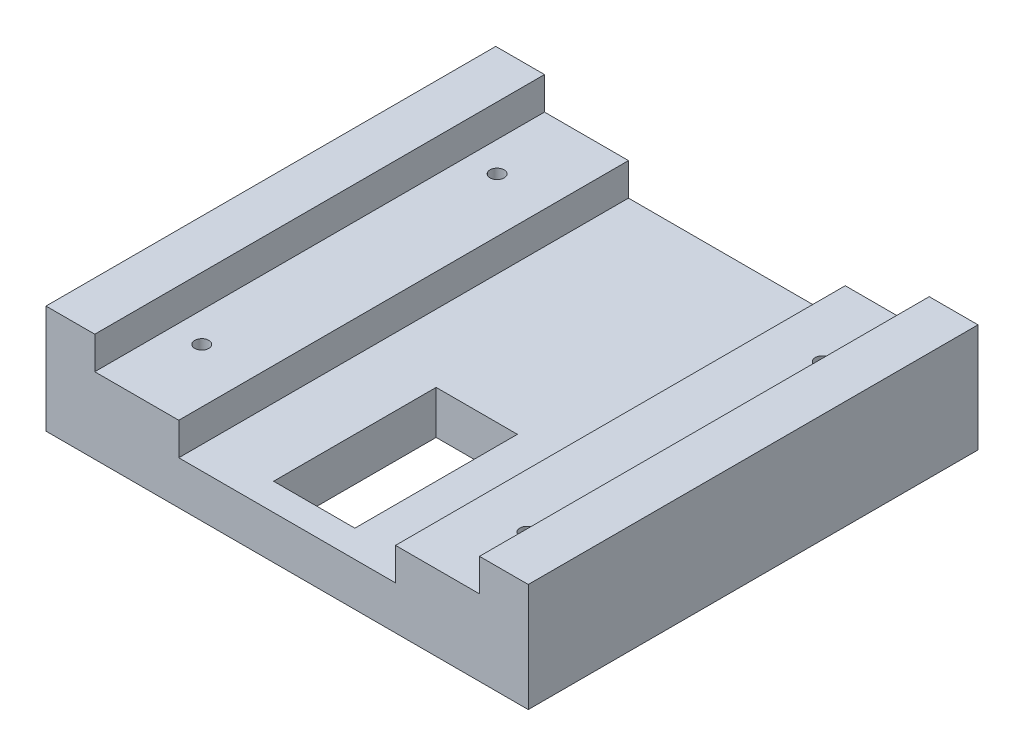
ISO-10303-21;
HEADER;
FILE_DESCRIPTION(('STEP AP214'),'2;1');
FILE_NAME('part.step','',(''),(''),'','','');
FILE_SCHEMA(('AUTOMOTIVE_DESIGN { 1 0 10303 214 1 1 1 1 }'));
ENDSEC;
DATA;
#1=APPLICATION_CONTEXT('core data for automotive mechanical design processes');
#2=APPLICATION_PROTOCOL_DEFINITION('international standard','automotive_design',2000,#1);
#3=PRODUCT_CONTEXT('',#1,'mechanical');
#4=PRODUCT('Part','Part','',(#3));
#5=PRODUCT_RELATED_PRODUCT_CATEGORY('part','',(#4));
#6=PRODUCT_DEFINITION_FORMATION('','',#4);
#7=PRODUCT_DEFINITION_CONTEXT('part definition',#1,'design');
#8=PRODUCT_DEFINITION('design','',#6,#7);
#9=PRODUCT_DEFINITION_SHAPE('','',#8);
#10=(LENGTH_UNIT() NAMED_UNIT(*) SI_UNIT(.MILLI.,.METRE.));
#11=(NAMED_UNIT(*) PLANE_ANGLE_UNIT() SI_UNIT($,.RADIAN.));
#12=(NAMED_UNIT(*) SI_UNIT($,.STERADIAN.) SOLID_ANGLE_UNIT());
#13=UNCERTAINTY_MEASURE_WITH_UNIT(LENGTH_MEASURE(1.E-05),#10,'distance_accuracy_value','');
#14=(GEOMETRIC_REPRESENTATION_CONTEXT(3) GLOBAL_UNCERTAINTY_ASSIGNED_CONTEXT((#13)) GLOBAL_UNIT_ASSIGNED_CONTEXT((#10,
#11,#12)) REPRESENTATION_CONTEXT('',''));
#15=CARTESIAN_POINT('',(0.,0.,0.));
#16=DIRECTION('',(0.,0.,1.));
#17=DIRECTION('',(1.,0.,0.));
#18=AXIS2_PLACEMENT_3D('',#15,#16,#17);
#19=CARTESIAN_POINT('',(0.,14.,0.));
#20=DIRECTION('',(0.,1.,0.));
#21=DIRECTION('',(0.,0.,1.));
#22=AXIS2_PLACEMENT_3D('',#19,#20,#21);
#23=PLANE('',#22);
#24=CARTESIAN_POINT('',(30.,14.,-68.75));
#25=DIRECTION('',(0.,1.,0.));
#26=DIRECTION('',(0.,0.,1.));
#27=AXIS2_PLACEMENT_3D('',#24,#25,#26);
#28=CIRCLE('',#27,1.29999999999999);
#29=CARTESIAN_POINT('',(30.,14.,-67.45));
#30=VERTEX_POINT('',#29);
#31=EDGE_CURVE('E236',#30,#30,#28,.T.);
#32=ORIENTED_EDGE('',*,*,#31,.F.);
#33=EDGE_LOOP('',(#32));
#34=FACE_BOUND('',#33,.T.);
#35=CARTESIAN_POINT('',(30.,14.,-14.25));
#36=DIRECTION('',(0.,1.,0.));
#37=DIRECTION('',(0.,0.,1.));
#38=AXIS2_PLACEMENT_3D('',#35,#36,#37);
#39=CIRCLE('',#38,1.3);
#40=CARTESIAN_POINT('',(30.,14.,-12.95));
#41=VERTEX_POINT('',#40);
#42=EDGE_CURVE('E246',#41,#41,#39,.T.);
#43=ORIENTED_EDGE('',*,*,#42,.F.);
#44=EDGE_LOOP('',(#43));
#45=FACE_BOUND('',#44,.T.);
#46=DIRECTION('',(1.,0.,0.));
#47=VECTOR('',#46,1.);
#48=CARTESIAN_POINT('',(0.,14.,0.));
#49=LINE('',#48,#47);
#50=CARTESIAN_POINT('',(20.,14.,0.));
#51=VERTEX_POINT('',#50);
#52=CARTESIAN_POINT('',(35.5,14.,0.));
#53=VERTEX_POINT('',#52);
#54=EDGE_CURVE('E55',#51,#53,#49,.T.);
#55=ORIENTED_EDGE('',*,*,#54,.T.);
#56=DIRECTION('',(0.,0.,1.));
#57=VECTOR('',#56,1.);
#58=CARTESIAN_POINT('',(35.5,14.,0.));
#59=LINE('',#58,#57);
#60=CARTESIAN_POINT('',(35.5,14.,-83.));
#61=VERTEX_POINT('',#60);
#62=EDGE_CURVE('E50',#61,#53,#59,.T.);
#63=ORIENTED_EDGE('',*,*,#62,.F.);
#64=DIRECTION('',(1.,0.,0.));
#65=VECTOR('',#64,1.);
#66=CARTESIAN_POINT('',(0.,14.,-83.));
#67=LINE('',#66,#65);
#68=CARTESIAN_POINT('',(20.,14.,-83.));
#69=VERTEX_POINT('',#68);
#70=EDGE_CURVE('E251',#69,#61,#67,.T.);
#71=ORIENTED_EDGE('',*,*,#70,.F.);
#72=DIRECTION('',(0.,0.,-1.));
#73=VECTOR('',#72,1.);
#74=CARTESIAN_POINT('',(20.,14.,0.));
#75=LINE('',#74,#73);
#76=EDGE_CURVE('E205',#51,#69,#75,.T.);
#77=ORIENTED_EDGE('',*,*,#76,.F.);
#78=EDGE_LOOP('',(#55,#63,#71,#77));
#79=FACE_BOUND('',#78,.T.);
#80=ADVANCED_FACE('F35',(#34,#45,#79),#23,.T.);
#81=CARTESIAN_POINT('',(-30.,14.,-14.25));
#82=DIRECTION('',(0.,1.,0.));
#83=DIRECTION('',(0.,0.,1.));
#84=AXIS2_PLACEMENT_3D('',#81,#82,#83);
#85=CIRCLE('',#84,1.3);
#86=CARTESIAN_POINT('',(-30.,14.,-12.95));
#87=VERTEX_POINT('',#86);
#88=EDGE_CURVE('E243',#87,#87,#85,.T.);
#89=ORIENTED_EDGE('',*,*,#88,.F.);
#90=EDGE_LOOP('',(#89));
#91=FACE_BOUND('',#90,.T.);
#92=CARTESIAN_POINT('',(-30.,14.,-68.75));
#93=DIRECTION('',(0.,1.,0.));
#94=DIRECTION('',(0.,0.,1.));
#95=AXIS2_PLACEMENT_3D('',#92,#93,#94);
#96=CIRCLE('',#95,1.29999999999999);
#97=CARTESIAN_POINT('',(-30.,14.,-67.45));
#98=VERTEX_POINT('',#97);
#99=EDGE_CURVE('E239',#98,#98,#96,.T.);
#100=ORIENTED_EDGE('',*,*,#99,.F.);
#101=EDGE_LOOP('',(#100));
#102=FACE_BOUND('',#101,.T.);
#103=CARTESIAN_POINT('',(-35.5,14.,-83.));
#104=VERTEX_POINT('',#103);
#105=CARTESIAN_POINT('',(-20.,14.,-83.));
#106=VERTEX_POINT('',#105);
#107=EDGE_CURVE('E252',#104,#106,#67,.T.);
#108=ORIENTED_EDGE('',*,*,#107,.F.);
#109=DIRECTION('',(0.,0.,-1.));
#110=VECTOR('',#109,1.);
#111=CARTESIAN_POINT('',(-35.5,14.,-83.));
#112=LINE('',#111,#110);
#113=CARTESIAN_POINT('',(-35.5,14.,0.));
#114=VERTEX_POINT('',#113);
#115=EDGE_CURVE('E183',#114,#104,#112,.T.);
#116=ORIENTED_EDGE('',*,*,#115,.F.);
#117=CARTESIAN_POINT('',(-20.,14.,0.));
#118=VERTEX_POINT('',#117);
#119=EDGE_CURVE('E249',#114,#118,#49,.T.);
#120=ORIENTED_EDGE('',*,*,#119,.T.);
#121=DIRECTION('',(0.,0.,1.));
#122=VECTOR('',#121,1.);
#123=CARTESIAN_POINT('',(-20.,14.,0.));
#124=LINE('',#123,#122);
#125=EDGE_CURVE('E200',#106,#118,#124,.T.);
#126=ORIENTED_EDGE('',*,*,#125,.F.);
#127=EDGE_LOOP('',(#108,#116,#120,#126));
#128=FACE_BOUND('',#127,.T.);
#129=ADVANCED_FACE('F332',(#91,#102,#128),#23,.T.);
#130=CARTESIAN_POINT('',(0.,14.,0.));
#131=DIRECTION('',(0.,0.,-1.));
#132=DIRECTION('',(-1.,0.,0.));
#133=AXIS2_PLACEMENT_3D('',#130,#131,#132);
#134=PLANE('',#133);
#135=DIRECTION('',(1.,0.,0.));
#136=VECTOR('',#135,1.);
#137=CARTESIAN_POINT('',(-20.,8.,0.));
#138=LINE('',#137,#136);
#139=CARTESIAN_POINT('',(-20.,8.,0.));
#140=VERTEX_POINT('',#139);
#141=CARTESIAN_POINT('',(20.,8.,0.));
#142=VERTEX_POINT('',#141);
#143=EDGE_CURVE('E204',#140,#142,#138,.T.);
#144=ORIENTED_EDGE('',*,*,#143,.F.);
#145=DIRECTION('',(0.,1.,0.));
#146=VECTOR('',#145,1.);
#147=CARTESIAN_POINT('',(-20.,8.,0.));
#148=LINE('',#147,#146);
#149=EDGE_CURVE('E214',#140,#118,#148,.T.);
#150=ORIENTED_EDGE('',*,*,#149,.T.);
#151=ORIENTED_EDGE('',*,*,#119,.F.);
#152=DIRECTION('',(0.,-1.,0.));
#153=VECTOR('',#152,1.);
#154=CARTESIAN_POINT('',(-35.5,20.,0.));
#155=LINE('',#154,#153);
#156=CARTESIAN_POINT('',(-35.5,20.,0.));
#157=VERTEX_POINT('',#156);
#158=EDGE_CURVE('E198',#157,#114,#155,.T.);
#159=ORIENTED_EDGE('',*,*,#158,.F.);
#160=DIRECTION('',(1.,0.,0.));
#161=VECTOR('',#160,1.);
#162=CARTESIAN_POINT('',(-44.5,20.,0.));
#163=LINE('',#162,#161);
#164=CARTESIAN_POINT('',(-44.5,20.,0.));
#165=VERTEX_POINT('',#164);
#166=EDGE_CURVE('E187',#165,#157,#163,.T.);
#167=ORIENTED_EDGE('',*,*,#166,.F.);
#168=DIRECTION('',(0.,-1.,0.));
#169=VECTOR('',#168,1.);
#170=CARTESIAN_POINT('',(-44.5,14.,0.));
#171=LINE('',#170,#169);
#172=CARTESIAN_POINT('',(-44.5,0.,0.));
#173=VERTEX_POINT('',#172);
#174=EDGE_CURVE('E286',#165,#173,#171,.T.);
#175=ORIENTED_EDGE('',*,*,#174,.T.);
#176=DIRECTION('',(1.,0.,0.));
#177=VECTOR('',#176,1.);
#178=CARTESIAN_POINT('',(0.,0.,0.));
#179=LINE('',#178,#177);
#180=CARTESIAN_POINT('',(44.5,0.,0.));
#181=VERTEX_POINT('',#180);
#182=EDGE_CURVE('E278',#173,#181,#179,.T.);
#183=ORIENTED_EDGE('',*,*,#182,.T.);
#184=DIRECTION('',(0.,-1.,0.));
#185=VECTOR('',#184,1.);
#186=CARTESIAN_POINT('',(44.5,14.,0.));
#187=LINE('',#186,#185);
#188=CARTESIAN_POINT('',(44.5,20.,0.));
#189=VERTEX_POINT('',#188);
#190=EDGE_CURVE('E43',#189,#181,#187,.T.);
#191=ORIENTED_EDGE('',*,*,#190,.F.);
#192=DIRECTION('',(1.,0.,0.));
#193=VECTOR('',#192,1.);
#194=CARTESIAN_POINT('',(44.5,20.,0.));
#195=LINE('',#194,#193);
#196=CARTESIAN_POINT('',(35.5,20.,0.));
#197=VERTEX_POINT('',#196);
#198=EDGE_CURVE('E173',#197,#189,#195,.T.);
#199=ORIENTED_EDGE('',*,*,#198,.F.);
#200=DIRECTION('',(0.,-1.,0.));
#201=VECTOR('',#200,1.);
#202=CARTESIAN_POINT('',(35.5,20.,0.));
#203=LINE('',#202,#201);
#204=EDGE_CURVE('E178',#197,#53,#203,.T.);
#205=ORIENTED_EDGE('',*,*,#204,.T.);
#206=ORIENTED_EDGE('',*,*,#54,.F.);
#207=DIRECTION('',(0.,1.,0.));
#208=VECTOR('',#207,1.);
#209=CARTESIAN_POINT('',(20.,8.,0.));
#210=LINE('',#209,#208);
#211=EDGE_CURVE('E225',#142,#51,#210,.T.);
#212=ORIENTED_EDGE('',*,*,#211,.F.);
#213=EDGE_LOOP('',(#144,#150,#151,#159,#167,#175,#183,#191,#199,#205,#206,#212));
#214=FACE_BOUND('',#213,.T.);
#215=ADVANCED_FACE('F338',(#214),#134,.F.);
#216=CARTESIAN_POINT('',(44.5,14.,0.));
#217=DIRECTION('',(-1.,0.,0.));
#218=DIRECTION('',(0.,0.,1.));
#219=AXIS2_PLACEMENT_3D('',#216,#217,#218);
#220=PLANE('',#219);
#221=DIRECTION('',(0.,0.,-1.));
#222=VECTOR('',#221,1.);
#223=CARTESIAN_POINT('',(44.5,0.,0.));
#224=LINE('',#223,#222);
#225=CARTESIAN_POINT('',(44.5,0.,-83.));
#226=VERTEX_POINT('',#225);
#227=EDGE_CURVE('E154',#181,#226,#224,.T.);
#228=ORIENTED_EDGE('',*,*,#227,.T.);
#229=DIRECTION('',(0.,-1.,0.));
#230=VECTOR('',#229,1.);
#231=CARTESIAN_POINT('',(44.5,14.,-83.));
#232=LINE('',#231,#230);
#233=CARTESIAN_POINT('',(44.5,20.,-83.));
#234=VERTEX_POINT('',#233);
#235=EDGE_CURVE('E148',#234,#226,#232,.T.);
#236=ORIENTED_EDGE('',*,*,#235,.F.);
#237=DIRECTION('',(0.,0.,-1.));
#238=VECTOR('',#237,1.);
#239=CARTESIAN_POINT('',(44.5,20.,0.));
#240=LINE('',#239,#238);
#241=EDGE_CURVE('E153',#189,#234,#240,.T.);
#242=ORIENTED_EDGE('',*,*,#241,.F.);
#243=ORIENTED_EDGE('',*,*,#190,.T.);
#244=EDGE_LOOP('',(#228,#236,#242,#243));
#245=FACE_BOUND('',#244,.T.);
#246=ADVANCED_FACE('F150',(#245),#220,.F.);
#247=CARTESIAN_POINT('',(0.,14.,-83.));
#248=DIRECTION('',(0.,0.,-1.));
#249=DIRECTION('',(-1.,0.,0.));
#250=AXIS2_PLACEMENT_3D('',#247,#248,#249);
#251=PLANE('',#250);
#252=DIRECTION('',(0.,1.,0.));
#253=VECTOR('',#252,1.);
#254=CARTESIAN_POINT('',(-20.,8.,-83.));
#255=LINE('',#254,#253);
#256=CARTESIAN_POINT('',(-20.,8.,-83.));
#257=VERTEX_POINT('',#256);
#258=EDGE_CURVE('E218',#257,#106,#255,.T.);
#259=ORIENTED_EDGE('',*,*,#258,.F.);
#260=DIRECTION('',(-1.,0.,0.));
#261=VECTOR('',#260,1.);
#262=CARTESIAN_POINT('',(-20.,8.,-83.));
#263=LINE('',#262,#261);
#264=CARTESIAN_POINT('',(20.,8.,-83.));
#265=VERTEX_POINT('',#264);
#266=EDGE_CURVE('E211',#265,#257,#263,.T.);
#267=ORIENTED_EDGE('',*,*,#266,.F.);
#268=DIRECTION('',(0.,1.,0.));
#269=VECTOR('',#268,1.);
#270=CARTESIAN_POINT('',(20.,8.,-83.));
#271=LINE('',#270,#269);
#272=EDGE_CURVE('E222',#265,#69,#271,.T.);
#273=ORIENTED_EDGE('',*,*,#272,.T.);
#274=ORIENTED_EDGE('',*,*,#70,.T.);
#275=DIRECTION('',(0.,-1.,0.));
#276=VECTOR('',#275,1.);
#277=CARTESIAN_POINT('',(35.5,20.,-83.));
#278=LINE('',#277,#276);
#279=CARTESIAN_POINT('',(35.5,20.,-83.));
#280=VERTEX_POINT('',#279);
#281=EDGE_CURVE('E165',#280,#61,#278,.T.);
#282=ORIENTED_EDGE('',*,*,#281,.F.);
#283=DIRECTION('',(-1.,0.,0.));
#284=VECTOR('',#283,1.);
#285=CARTESIAN_POINT('',(44.5,20.,-83.));
#286=LINE('',#285,#284);
#287=EDGE_CURVE('E161',#234,#280,#286,.T.);
#288=ORIENTED_EDGE('',*,*,#287,.F.);
#289=ORIENTED_EDGE('',*,*,#235,.T.);
#290=DIRECTION('',(1.,0.,0.));
#291=VECTOR('',#290,1.);
#292=CARTESIAN_POINT('',(0.,0.,-83.));
#293=LINE('',#292,#291);
#294=CARTESIAN_POINT('',(-44.5,0.,-83.));
#295=VERTEX_POINT('',#294);
#296=EDGE_CURVE('E282',#295,#226,#293,.T.);
#297=ORIENTED_EDGE('',*,*,#296,.F.);
#298=DIRECTION('',(0.,-1.,0.));
#299=VECTOR('',#298,1.);
#300=CARTESIAN_POINT('',(-44.5,14.,-83.));
#301=LINE('',#300,#299);
#302=CARTESIAN_POINT('',(-44.5,20.,-83.));
#303=VERTEX_POINT('',#302);
#304=EDGE_CURVE('E158',#303,#295,#301,.T.);
#305=ORIENTED_EDGE('',*,*,#304,.F.);
#306=DIRECTION('',(-1.,0.,0.));
#307=VECTOR('',#306,1.);
#308=CARTESIAN_POINT('',(-44.5,20.,-83.));
#309=LINE('',#308,#307);
#310=CARTESIAN_POINT('',(-35.5,20.,-83.));
#311=VERTEX_POINT('',#310);
#312=EDGE_CURVE('E191',#311,#303,#309,.T.);
#313=ORIENTED_EDGE('',*,*,#312,.F.);
#314=DIRECTION('',(0.,-1.,0.));
#315=VECTOR('',#314,1.);
#316=CARTESIAN_POINT('',(-35.5,20.,-83.));
#317=LINE('',#316,#315);
#318=EDGE_CURVE('E194',#311,#104,#317,.T.);
#319=ORIENTED_EDGE('',*,*,#318,.T.);
#320=ORIENTED_EDGE('',*,*,#107,.T.);
#321=EDGE_LOOP('',(#259,#267,#273,#274,#282,#288,#289,#297,#305,#313,#319,#320));
#322=FACE_BOUND('',#321,.T.);
#323=ADVANCED_FACE('F163',(#322),#251,.T.);
#324=CARTESIAN_POINT('',(7.5,14.,0.));
#325=DIRECTION('',(-1.,0.,0.));
#326=DIRECTION('',(0.,0.,1.));
#327=AXIS2_PLACEMENT_3D('',#324,#325,#326);
#328=PLANE('',#327);
#329=DIRECTION('',(0.,0.,1.));
#330=VECTOR('',#329,1.);
#331=CARTESIAN_POINT('',(7.5,8.,0.));
#332=LINE('',#331,#330);
#333=CARTESIAN_POINT('',(7.5,8.,-35.));
#334=VERTEX_POINT('',#333);
#335=CARTESIAN_POINT('',(7.5,8.,-5.));
#336=VERTEX_POINT('',#335);
#337=EDGE_CURVE('E233',#334,#336,#332,.T.);
#338=ORIENTED_EDGE('',*,*,#337,.F.);
#339=DIRECTION('',(0.,-1.,0.));
#340=VECTOR('',#339,1.);
#341=CARTESIAN_POINT('',(7.5,14.,-35.));
#342=LINE('',#341,#340);
#343=CARTESIAN_POINT('',(7.5,0.,-35.));
#344=VERTEX_POINT('',#343);
#345=EDGE_CURVE('E254',#334,#344,#342,.T.);
#346=ORIENTED_EDGE('',*,*,#345,.T.);
#347=DIRECTION('',(0.,0.,-1.));
#348=VECTOR('',#347,1.);
#349=CARTESIAN_POINT('',(7.5,0.,0.));
#350=LINE('',#349,#348);
#351=CARTESIAN_POINT('',(7.5,0.,-5.));
#352=VERTEX_POINT('',#351);
#353=EDGE_CURVE('E266',#352,#344,#350,.T.);
#354=ORIENTED_EDGE('',*,*,#353,.F.);
#355=DIRECTION('',(0.,-1.,0.));
#356=VECTOR('',#355,1.);
#357=CARTESIAN_POINT('',(7.5,14.,-5.));
#358=LINE('',#357,#356);
#359=EDGE_CURVE('E288',#336,#352,#358,.T.);
#360=ORIENTED_EDGE('',*,*,#359,.F.);
#361=EDGE_LOOP('',(#338,#346,#354,#360));
#362=FACE_BOUND('',#361,.T.);
#363=ADVANCED_FACE('F304',(#362),#328,.T.);
#364=CARTESIAN_POINT('',(0.,14.,-5.));
#365=DIRECTION('',(0.,0.,-1.));
#366=DIRECTION('',(-1.,0.,0.));
#367=AXIS2_PLACEMENT_3D('',#364,#365,#366);
#368=PLANE('',#367);
#369=DIRECTION('',(-1.,0.,0.));
#370=VECTOR('',#369,1.);
#371=CARTESIAN_POINT('',(0.,8.,-5.));
#372=LINE('',#371,#370);
#373=CARTESIAN_POINT('',(-7.5,8.,-5.));
#374=VERTEX_POINT('',#373);
#375=EDGE_CURVE('E231',#336,#374,#372,.T.);
#376=ORIENTED_EDGE('',*,*,#375,.F.);
#377=ORIENTED_EDGE('',*,*,#359,.T.);
#378=DIRECTION('',(1.,0.,0.));
#379=VECTOR('',#378,1.);
#380=CARTESIAN_POINT('',(0.,0.,-5.));
#381=LINE('',#380,#379);
#382=CARTESIAN_POINT('',(-7.5,0.,-5.));
#383=VERTEX_POINT('',#382);
#384=EDGE_CURVE('E269',#383,#352,#381,.T.);
#385=ORIENTED_EDGE('',*,*,#384,.F.);
#386=DIRECTION('',(0.,-1.,0.));
#387=VECTOR('',#386,1.);
#388=CARTESIAN_POINT('',(-7.5,14.,-5.));
#389=LINE('',#388,#387);
#390=EDGE_CURVE('E294',#374,#383,#389,.T.);
#391=ORIENTED_EDGE('',*,*,#390,.F.);
#392=EDGE_LOOP('',(#376,#377,#385,#391));
#393=FACE_BOUND('',#392,.T.);
#394=ADVANCED_FACE('F300',(#393),#368,.T.);
#395=CARTESIAN_POINT('',(-7.5,14.,0.));
#396=DIRECTION('',(-1.,0.,0.));
#397=DIRECTION('',(0.,0.,1.));
#398=AXIS2_PLACEMENT_3D('',#395,#396,#397);
#399=PLANE('',#398);
#400=DIRECTION('',(0.,-1.,0.));
#401=VECTOR('',#400,1.);
#402=CARTESIAN_POINT('',(-7.5,14.,-35.));
#403=LINE('',#402,#401);
#404=CARTESIAN_POINT('',(-7.5,8.,-35.));
#405=VERTEX_POINT('',#404);
#406=CARTESIAN_POINT('',(-7.5,0.,-35.));
#407=VERTEX_POINT('',#406);
#408=EDGE_CURVE('E292',#405,#407,#403,.T.);
#409=ORIENTED_EDGE('',*,*,#408,.F.);
#410=DIRECTION('',(0.,0.,1.));
#411=VECTOR('',#410,1.);
#412=CARTESIAN_POINT('',(-7.5,8.,0.));
#413=LINE('',#412,#411);
#414=EDGE_CURVE('E221',#405,#374,#413,.T.);
#415=ORIENTED_EDGE('',*,*,#414,.T.);
#416=ORIENTED_EDGE('',*,*,#390,.T.);
#417=DIRECTION('',(0.,0.,-1.));
#418=VECTOR('',#417,1.);
#419=CARTESIAN_POINT('',(-7.5,0.,0.));
#420=LINE('',#419,#418);
#421=EDGE_CURVE('E272',#383,#407,#420,.T.);
#422=ORIENTED_EDGE('',*,*,#421,.T.);
#423=EDGE_LOOP('',(#409,#415,#416,#422));
#424=FACE_BOUND('',#423,.T.);
#425=ADVANCED_FACE('F313',(#424),#399,.F.);
#426=CARTESIAN_POINT('',(0.,14.,-35.));
#427=DIRECTION('',(0.,0.,-1.));
#428=DIRECTION('',(-1.,0.,0.));
#429=AXIS2_PLACEMENT_3D('',#426,#427,#428);
#430=PLANE('',#429);
#431=ORIENTED_EDGE('',*,*,#345,.F.);
#432=DIRECTION('',(-1.,0.,0.));
#433=VECTOR('',#432,1.);
#434=CARTESIAN_POINT('',(0.,8.,-35.));
#435=LINE('',#434,#433);
#436=EDGE_CURVE('E11',#334,#405,#435,.T.);
#437=ORIENTED_EDGE('',*,*,#436,.T.);
#438=ORIENTED_EDGE('',*,*,#408,.T.);
#439=DIRECTION('',(1.,0.,0.));
#440=VECTOR('',#439,1.);
#441=CARTESIAN_POINT('',(0.,0.,-35.));
#442=LINE('',#441,#440);
#443=EDGE_CURVE('E275',#407,#344,#442,.T.);
#444=ORIENTED_EDGE('',*,*,#443,.T.);
#445=EDGE_LOOP('',(#431,#437,#438,#444));
#446=FACE_BOUND('',#445,.T.);
#447=ADVANCED_FACE('F318',(#446),#430,.F.);
#448=CARTESIAN_POINT('',(30.,14.,-14.25));
#449=DIRECTION('',(0.,-1.,0.));
#450=DIRECTION('',(0.,0.,-1.));
#451=AXIS2_PLACEMENT_3D('',#448,#449,#450);
#452=CYLINDRICAL_SURFACE('',#451,1.3);
#453=ORIENTED_EDGE('',*,*,#42,.T.);
#454=EDGE_LOOP('',(#453));
#455=FACE_BOUND('',#454,.T.);
#456=CARTESIAN_POINT('',(30.,0.,-14.25));
#457=DIRECTION('',(0.,1.,0.));
#458=DIRECTION('',(0.,0.,1.));
#459=AXIS2_PLACEMENT_3D('',#456,#457,#458);
#460=CIRCLE('',#459,1.3);
#461=CARTESIAN_POINT('',(30.,0.,-12.95));
#462=VERTEX_POINT('',#461);
#463=EDGE_CURVE('E263',#462,#462,#460,.T.);
#464=ORIENTED_EDGE('',*,*,#463,.F.);
#465=EDGE_LOOP('',(#464));
#466=FACE_BOUND('',#465,.T.);
#467=ADVANCED_FACE('F320',(#455,#466),#452,.F.);
#468=CARTESIAN_POINT('',(-30.,14.,-14.25));
#469=DIRECTION('',(0.,-1.,0.));
#470=DIRECTION('',(0.,0.,-1.));
#471=AXIS2_PLACEMENT_3D('',#468,#469,#470);
#472=CYLINDRICAL_SURFACE('',#471,1.3);
#473=ORIENTED_EDGE('',*,*,#88,.T.);
#474=EDGE_LOOP('',(#473));
#475=FACE_BOUND('',#474,.T.);
#476=CARTESIAN_POINT('',(-30.,0.,-14.25));
#477=DIRECTION('',(0.,1.,0.));
#478=DIRECTION('',(0.,0.,1.));
#479=AXIS2_PLACEMENT_3D('',#476,#477,#478);
#480=CIRCLE('',#479,1.3);
#481=CARTESIAN_POINT('',(-30.,0.,-12.95));
#482=VERTEX_POINT('',#481);
#483=EDGE_CURVE('E260',#482,#482,#480,.T.);
#484=ORIENTED_EDGE('',*,*,#483,.F.);
#485=EDGE_LOOP('',(#484));
#486=FACE_BOUND('',#485,.T.);
#487=ADVANCED_FACE('F326',(#475,#486),#472,.F.);
#488=CARTESIAN_POINT('',(-30.,14.,-68.75));
#489=DIRECTION('',(0.,-1.,0.));
#490=DIRECTION('',(0.,0.,-1.));
#491=AXIS2_PLACEMENT_3D('',#488,#489,#490);
#492=CYLINDRICAL_SURFACE('',#491,1.29999999999999);
#493=ORIENTED_EDGE('',*,*,#99,.T.);
#494=EDGE_LOOP('',(#493));
#495=FACE_BOUND('',#494,.T.);
#496=CARTESIAN_POINT('',(-30.,0.,-68.75));
#497=DIRECTION('',(0.,1.,0.));
#498=DIRECTION('',(0.,0.,1.));
#499=AXIS2_PLACEMENT_3D('',#496,#497,#498);
#500=CIRCLE('',#499,1.29999999999999);
#501=CARTESIAN_POINT('',(-30.,0.,-67.45));
#502=VERTEX_POINT('',#501);
#503=EDGE_CURVE('E257',#502,#502,#500,.T.);
#504=ORIENTED_EDGE('',*,*,#503,.F.);
#505=EDGE_LOOP('',(#504));
#506=FACE_BOUND('',#505,.T.);
#507=ADVANCED_FACE('F421',(#495,#506),#492,.F.);
#508=CARTESIAN_POINT('',(30.,14.,-68.75));
#509=DIRECTION('',(0.,-1.,0.));
#510=DIRECTION('',(0.,0.,-1.));
#511=AXIS2_PLACEMENT_3D('',#508,#509,#510);
#512=CYLINDRICAL_SURFACE('',#511,1.29999999999999);
#513=ORIENTED_EDGE('',*,*,#31,.T.);
#514=EDGE_LOOP('',(#513));
#515=FACE_BOUND('',#514,.T.);
#516=CARTESIAN_POINT('',(30.,0.,-68.75));
#517=DIRECTION('',(0.,1.,0.));
#518=DIRECTION('',(0.,0.,1.));
#519=AXIS2_PLACEMENT_3D('',#516,#517,#518);
#520=CIRCLE('',#519,1.29999999999999);
#521=CARTESIAN_POINT('',(30.,0.,-67.45));
#522=VERTEX_POINT('',#521);
#523=EDGE_CURVE('E235',#522,#522,#520,.T.);
#524=ORIENTED_EDGE('',*,*,#523,.F.);
#525=EDGE_LOOP('',(#524));
#526=FACE_BOUND('',#525,.T.);
#527=ADVANCED_FACE('F37',(#515,#526),#512,.F.);
#528=CARTESIAN_POINT('',(-44.5,14.,0.));
#529=DIRECTION('',(-1.,0.,0.));
#530=DIRECTION('',(0.,0.,1.));
#531=AXIS2_PLACEMENT_3D('',#528,#529,#530);
#532=PLANE('',#531);
#533=DIRECTION('',(0.,0.,-1.));
#534=VECTOR('',#533,1.);
#535=CARTESIAN_POINT('',(-44.5,0.,0.));
#536=LINE('',#535,#534);
#537=EDGE_CURVE('E240',#173,#295,#536,.T.);
#538=ORIENTED_EDGE('',*,*,#537,.F.);
#539=ORIENTED_EDGE('',*,*,#174,.F.);
#540=DIRECTION('',(0.,0.,1.));
#541=VECTOR('',#540,1.);
#542=CARTESIAN_POINT('',(-44.5,20.,-83.));
#543=LINE('',#542,#541);
#544=EDGE_CURVE('E184',#303,#165,#543,.T.);
#545=ORIENTED_EDGE('',*,*,#544,.F.);
#546=ORIENTED_EDGE('',*,*,#304,.T.);
#547=EDGE_LOOP('',(#538,#539,#545,#546));
#548=FACE_BOUND('',#547,.T.);
#549=ADVANCED_FACE('F348',(#548),#532,.T.);
#550=CARTESIAN_POINT('',(0.,0.,0.));
#551=DIRECTION('',(0.,1.,0.));
#552=DIRECTION('',(0.,0.,1.));
#553=AXIS2_PLACEMENT_3D('',#550,#551,#552);
#554=PLANE('',#553);
#555=ORIENTED_EDGE('',*,*,#523,.T.);
#556=EDGE_LOOP('',(#555));
#557=FACE_BOUND('',#556,.T.);
#558=ORIENTED_EDGE('',*,*,#503,.T.);
#559=EDGE_LOOP('',(#558));
#560=FACE_BOUND('',#559,.T.);
#561=ORIENTED_EDGE('',*,*,#483,.T.);
#562=EDGE_LOOP('',(#561));
#563=FACE_BOUND('',#562,.T.);
#564=ORIENTED_EDGE('',*,*,#463,.T.);
#565=EDGE_LOOP('',(#564));
#566=FACE_BOUND('',#565,.T.);
#567=ORIENTED_EDGE('',*,*,#353,.T.);
#568=ORIENTED_EDGE('',*,*,#443,.F.);
#569=ORIENTED_EDGE('',*,*,#421,.F.);
#570=ORIENTED_EDGE('',*,*,#384,.T.);
#571=EDGE_LOOP('',(#567,#568,#569,#570));
#572=FACE_BOUND('',#571,.T.);
#573=ORIENTED_EDGE('',*,*,#182,.F.);
#574=ORIENTED_EDGE('',*,*,#537,.T.);
#575=ORIENTED_EDGE('',*,*,#296,.T.);
#576=ORIENTED_EDGE('',*,*,#227,.F.);
#577=EDGE_LOOP('',(#573,#574,#575,#576));
#578=FACE_BOUND('',#577,.T.);
#579=ADVANCED_FACE('F309',(#557,#560,#563,#566,#572,#578),#554,.F.);
#580=CARTESIAN_POINT('',(-20.,8.,0.));
#581=DIRECTION('',(-1.,0.,0.));
#582=DIRECTION('',(0.,0.,1.));
#583=AXIS2_PLACEMENT_3D('',#580,#581,#582);
#584=PLANE('',#583);
#585=ORIENTED_EDGE('',*,*,#125,.T.);
#586=ORIENTED_EDGE('',*,*,#149,.F.);
#587=DIRECTION('',(0.,0.,1.));
#588=VECTOR('',#587,1.);
#589=CARTESIAN_POINT('',(-20.,8.,0.));
#590=LINE('',#589,#588);
#591=EDGE_CURVE('E201',#257,#140,#590,.T.);
#592=ORIENTED_EDGE('',*,*,#591,.F.);
#593=ORIENTED_EDGE('',*,*,#258,.T.);
#594=EDGE_LOOP('',(#585,#586,#592,#593));
#595=FACE_BOUND('',#594,.T.);
#596=ADVANCED_FACE('F344',(#595),#584,.F.);
#597=CARTESIAN_POINT('',(20.,8.,0.));
#598=DIRECTION('',(1.,0.,0.));
#599=DIRECTION('',(0.,0.,-1.));
#600=AXIS2_PLACEMENT_3D('',#597,#598,#599);
#601=PLANE('',#600);
#602=ORIENTED_EDGE('',*,*,#76,.T.);
#603=ORIENTED_EDGE('',*,*,#272,.F.);
#604=DIRECTION('',(0.,0.,-1.));
#605=VECTOR('',#604,1.);
#606=CARTESIAN_POINT('',(20.,8.,0.));
#607=LINE('',#606,#605);
#608=EDGE_CURVE('E208',#142,#265,#607,.T.);
#609=ORIENTED_EDGE('',*,*,#608,.F.);
#610=ORIENTED_EDGE('',*,*,#211,.T.);
#611=EDGE_LOOP('',(#602,#603,#609,#610));
#612=FACE_BOUND('',#611,.T.);
#613=ADVANCED_FACE('F396',(#612),#601,.F.);
#614=CARTESIAN_POINT('',(0.,8.,0.));
#615=DIRECTION('',(0.,-1.,0.));
#616=DIRECTION('',(0.,0.,-1.));
#617=AXIS2_PLACEMENT_3D('',#614,#615,#616);
#618=PLANE('',#617);
#619=ORIENTED_EDGE('',*,*,#337,.T.);
#620=ORIENTED_EDGE('',*,*,#375,.T.);
#621=ORIENTED_EDGE('',*,*,#414,.F.);
#622=ORIENTED_EDGE('',*,*,#436,.F.);
#623=EDGE_LOOP('',(#619,#620,#621,#622));
#624=FACE_BOUND('',#623,.T.);
#625=ORIENTED_EDGE('',*,*,#591,.T.);
#626=ORIENTED_EDGE('',*,*,#143,.T.);
#627=ORIENTED_EDGE('',*,*,#608,.T.);
#628=ORIENTED_EDGE('',*,*,#266,.T.);
#629=EDGE_LOOP('',(#625,#626,#627,#628));
#630=FACE_BOUND('',#629,.T.);
#631=ADVANCED_FACE('F315',(#624,#630),#618,.F.);
#632=CARTESIAN_POINT('',(-35.5,20.,-83.));
#633=DIRECTION('',(-1.,0.,0.));
#634=DIRECTION('',(0.,0.,1.));
#635=AXIS2_PLACEMENT_3D('',#632,#633,#634);
#636=PLANE('',#635);
#637=ORIENTED_EDGE('',*,*,#115,.T.);
#638=ORIENTED_EDGE('',*,*,#318,.F.);
#639=DIRECTION('',(0.,0.,-1.));
#640=VECTOR('',#639,1.);
#641=CARTESIAN_POINT('',(-35.5,20.,-83.));
#642=LINE('',#641,#640);
#643=EDGE_CURVE('E189',#157,#311,#642,.T.);
#644=ORIENTED_EDGE('',*,*,#643,.F.);
#645=ORIENTED_EDGE('',*,*,#158,.T.);
#646=EDGE_LOOP('',(#637,#638,#644,#645));
#647=FACE_BOUND('',#646,.T.);
#648=ADVANCED_FACE('F374',(#647),#636,.F.);
#649=CARTESIAN_POINT('',(0.,20.,0.));
#650=DIRECTION('',(0.,1.,0.));
#651=DIRECTION('',(0.,0.,1.));
#652=AXIS2_PLACEMENT_3D('',#649,#650,#651);
#653=PLANE('',#652);
#654=ORIENTED_EDGE('',*,*,#544,.T.);
#655=ORIENTED_EDGE('',*,*,#166,.T.);
#656=ORIENTED_EDGE('',*,*,#643,.T.);
#657=ORIENTED_EDGE('',*,*,#312,.T.);
#658=EDGE_LOOP('',(#654,#655,#656,#657));
#659=FACE_BOUND('',#658,.T.);
#660=ADVANCED_FACE('F377',(#659),#653,.T.);
#661=CARTESIAN_POINT('',(35.5,20.,0.));
#662=DIRECTION('',(1.,0.,0.));
#663=DIRECTION('',(0.,0.,-1.));
#664=AXIS2_PLACEMENT_3D('',#661,#662,#663);
#665=PLANE('',#664);
#666=ORIENTED_EDGE('',*,*,#62,.T.);
#667=ORIENTED_EDGE('',*,*,#204,.F.);
#668=DIRECTION('',(0.,0.,1.));
#669=VECTOR('',#668,1.);
#670=CARTESIAN_POINT('',(35.5,20.,0.));
#671=LINE('',#670,#669);
#672=EDGE_CURVE('E168',#280,#197,#671,.T.);
#673=ORIENTED_EDGE('',*,*,#672,.F.);
#674=ORIENTED_EDGE('',*,*,#281,.T.);
#675=EDGE_LOOP('',(#666,#667,#673,#674));
#676=FACE_BOUND('',#675,.T.);
#677=ADVANCED_FACE('F383',(#676),#665,.F.);
#678=CARTESIAN_POINT('',(0.,20.,0.));
#679=DIRECTION('',(0.,1.,0.));
#680=DIRECTION('',(0.,0.,1.));
#681=AXIS2_PLACEMENT_3D('',#678,#679,#680);
#682=PLANE('',#681);
#683=ORIENTED_EDGE('',*,*,#241,.T.);
#684=ORIENTED_EDGE('',*,*,#287,.T.);
#685=ORIENTED_EDGE('',*,*,#672,.T.);
#686=ORIENTED_EDGE('',*,*,#198,.T.);
#687=EDGE_LOOP('',(#683,#684,#685,#686));
#688=FACE_BOUND('',#687,.T.);
#689=ADVANCED_FACE('F171',(#688),#682,.T.);
#690=CLOSED_SHELL('',(#80,#129,#215,#246,#323,#363,#394,#425,#447,#467,#487,#507,#527,#549,#579,
#596,#613,#631,#648,#660,#677,#689));
#691=MANIFOLD_SOLID_BREP('B2',#690);
#692=ADVANCED_BREP_SHAPE_REPRESENTATION('',(#18,#691),#14);
#693=SHAPE_DEFINITION_REPRESENTATION(#9,#692);
ENDSEC;
END-ISO-10303-21;
